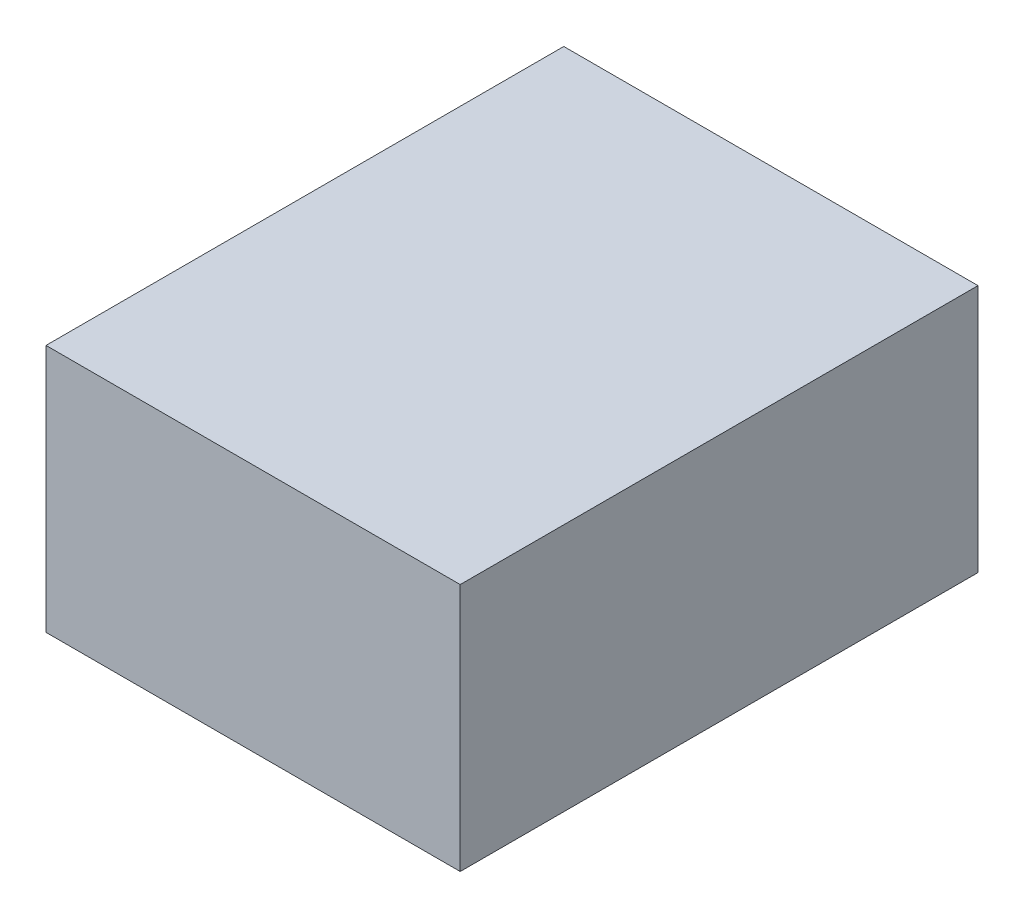
ISO-10303-21;
HEADER;
FILE_DESCRIPTION(('STEP AP214'),'2;1');
FILE_NAME('part.step','',(''),(''),'','','');
FILE_SCHEMA(('AUTOMOTIVE_DESIGN { 1 0 10303 214 1 1 1 1 }'));
ENDSEC;
DATA;
#1=APPLICATION_CONTEXT('core data for automotive mechanical design processes');
#2=APPLICATION_PROTOCOL_DEFINITION('international standard','automotive_design',2000,#1);
#3=PRODUCT_CONTEXT('',#1,'mechanical');
#4=PRODUCT('Part','Part','',(#3));
#5=PRODUCT_RELATED_PRODUCT_CATEGORY('part','',(#4));
#6=PRODUCT_DEFINITION_FORMATION('','',#4);
#7=PRODUCT_DEFINITION_CONTEXT('part definition',#1,'design');
#8=PRODUCT_DEFINITION('design','',#6,#7);
#9=PRODUCT_DEFINITION_SHAPE('','',#8);
#10=(LENGTH_UNIT() NAMED_UNIT(*) SI_UNIT(.MILLI.,.METRE.));
#11=(NAMED_UNIT(*) PLANE_ANGLE_UNIT() SI_UNIT($,.RADIAN.));
#12=(NAMED_UNIT(*) SI_UNIT($,.STERADIAN.) SOLID_ANGLE_UNIT());
#13=UNCERTAINTY_MEASURE_WITH_UNIT(LENGTH_MEASURE(1.E-05),#10,'distance_accuracy_value','');
#14=(GEOMETRIC_REPRESENTATION_CONTEXT(3) GLOBAL_UNCERTAINTY_ASSIGNED_CONTEXT((#13)) GLOBAL_UNIT_ASSIGNED_CONTEXT((#10,
#11,#12)) REPRESENTATION_CONTEXT('',''));
#15=CARTESIAN_POINT('',(0.,0.,0.));
#16=DIRECTION('',(0.,0.,1.));
#17=DIRECTION('',(1.,0.,0.));
#18=AXIS2_PLACEMENT_3D('',#15,#16,#17);
#19=CARTESIAN_POINT('',(1.,1.2,-1.25));
#20=DIRECTION('',(-1.,0.,0.));
#21=DIRECTION('',(0.,0.,1.));
#22=AXIS2_PLACEMENT_3D('',#19,#20,#21);
#23=PLANE('',#22);
#24=DIRECTION('',(0.,0.,-1.));
#25=VECTOR('',#24,1.);
#26=CARTESIAN_POINT('',(1.,0.,-1.25));
#27=LINE('',#26,#25);
#28=CARTESIAN_POINT('',(1.,0.,1.25));
#29=VERTEX_POINT('',#28);
#30=CARTESIAN_POINT('',(1.,0.,-1.25));
#31=VERTEX_POINT('',#30);
#32=EDGE_CURVE('E108',#29,#31,#27,.T.);
#33=ORIENTED_EDGE('',*,*,#32,.T.);
#34=DIRECTION('',(0.,-1.,0.));
#35=VECTOR('',#34,1.);
#36=CARTESIAN_POINT('',(1.,1.2,-1.25));
#37=LINE('',#36,#35);
#38=CARTESIAN_POINT('',(1.,1.2,-1.25));
#39=VERTEX_POINT('',#38);
#40=EDGE_CURVE('E11',#39,#31,#37,.T.);
#41=ORIENTED_EDGE('',*,*,#40,.F.);
#42=DIRECTION('',(0.,0.,-1.));
#43=VECTOR('',#42,1.);
#44=CARTESIAN_POINT('',(1.,1.2,-1.25));
#45=LINE('',#44,#43);
#46=CARTESIAN_POINT('',(1.,1.2,1.25));
#47=VERTEX_POINT('',#46);
#48=EDGE_CURVE('E96',#47,#39,#45,.T.);
#49=ORIENTED_EDGE('',*,*,#48,.F.);
#50=DIRECTION('',(0.,-1.,0.));
#51=VECTOR('',#50,1.);
#52=CARTESIAN_POINT('',(1.,1.2,1.25));
#53=LINE('',#52,#51);
#54=EDGE_CURVE('E104',#47,#29,#53,.T.);
#55=ORIENTED_EDGE('',*,*,#54,.T.);
#56=EDGE_LOOP('',(#33,#41,#49,#55));
#57=FACE_BOUND('',#56,.T.);
#58=ADVANCED_FACE('F45',(#57),#23,.F.);
#59=CARTESIAN_POINT('',(-1.,1.2,-1.25));
#60=DIRECTION('',(0.,0.,1.));
#61=DIRECTION('',(1.,0.,0.));
#62=AXIS2_PLACEMENT_3D('',#59,#60,#61);
#63=PLANE('',#62);
#64=DIRECTION('',(-1.,0.,0.));
#65=VECTOR('',#64,1.);
#66=CARTESIAN_POINT('',(-1.,0.,-1.25));
#67=LINE('',#66,#65);
#68=CARTESIAN_POINT('',(-1.,0.,-1.25));
#69=VERTEX_POINT('',#68);
#70=EDGE_CURVE('E100',#31,#69,#67,.T.);
#71=ORIENTED_EDGE('',*,*,#70,.T.);
#72=DIRECTION('',(0.,-1.,0.));
#73=VECTOR('',#72,1.);
#74=CARTESIAN_POINT('',(-1.,1.2,-1.25));
#75=LINE('',#74,#73);
#76=CARTESIAN_POINT('',(-1.,1.2,-1.25));
#77=VERTEX_POINT('',#76);
#78=EDGE_CURVE('E53',#77,#69,#75,.T.);
#79=ORIENTED_EDGE('',*,*,#78,.F.);
#80=DIRECTION('',(-1.,0.,0.));
#81=VECTOR('',#80,1.);
#82=CARTESIAN_POINT('',(-1.,1.2,-1.25));
#83=LINE('',#82,#81);
#84=EDGE_CURVE('E91',#39,#77,#83,.T.);
#85=ORIENTED_EDGE('',*,*,#84,.F.);
#86=ORIENTED_EDGE('',*,*,#40,.T.);
#87=EDGE_LOOP('',(#71,#79,#85,#86));
#88=FACE_BOUND('',#87,.T.);
#89=ADVANCED_FACE('F99',(#88),#63,.F.);
#90=CARTESIAN_POINT('',(-1.,1.2,-1.25));
#91=DIRECTION('',(1.,0.,0.));
#92=DIRECTION('',(0.,0.,-1.));
#93=AXIS2_PLACEMENT_3D('',#90,#91,#92);
#94=PLANE('',#93);
#95=DIRECTION('',(0.,0.,1.));
#96=VECTOR('',#95,1.);
#97=CARTESIAN_POINT('',(-1.,0.,-1.25));
#98=LINE('',#97,#96);
#99=CARTESIAN_POINT('',(-1.,0.,1.25));
#100=VERTEX_POINT('',#99);
#101=EDGE_CURVE('E78',#69,#100,#98,.T.);
#102=ORIENTED_EDGE('',*,*,#101,.T.);
#103=DIRECTION('',(0.,-1.,0.));
#104=VECTOR('',#103,1.);
#105=CARTESIAN_POINT('',(-1.,1.2,1.25));
#106=LINE('',#105,#104);
#107=CARTESIAN_POINT('',(-1.,1.2,1.25));
#108=VERTEX_POINT('',#107);
#109=EDGE_CURVE('E101',#108,#100,#106,.T.);
#110=ORIENTED_EDGE('',*,*,#109,.F.);
#111=DIRECTION('',(0.,0.,1.));
#112=VECTOR('',#111,1.);
#113=CARTESIAN_POINT('',(-1.,1.2,-1.25));
#114=LINE('',#113,#112);
#115=EDGE_CURVE('E94',#77,#108,#114,.T.);
#116=ORIENTED_EDGE('',*,*,#115,.F.);
#117=ORIENTED_EDGE('',*,*,#78,.T.);
#118=EDGE_LOOP('',(#102,#110,#116,#117));
#119=FACE_BOUND('',#118,.T.);
#120=ADVANCED_FACE('F102',(#119),#94,.F.);
#121=CARTESIAN_POINT('',(-1.,1.2,1.25));
#122=DIRECTION('',(0.,0.,-1.));
#123=DIRECTION('',(-1.,0.,0.));
#124=AXIS2_PLACEMENT_3D('',#121,#122,#123);
#125=PLANE('',#124);
#126=DIRECTION('',(1.,0.,0.));
#127=VECTOR('',#126,1.);
#128=CARTESIAN_POINT('',(-1.,0.,1.25));
#129=LINE('',#128,#127);
#130=EDGE_CURVE('E84',#100,#29,#129,.T.);
#131=ORIENTED_EDGE('',*,*,#130,.T.);
#132=ORIENTED_EDGE('',*,*,#54,.F.);
#133=DIRECTION('',(1.,0.,0.));
#134=VECTOR('',#133,1.);
#135=CARTESIAN_POINT('',(-1.,1.2,1.25));
#136=LINE('',#135,#134);
#137=EDGE_CURVE('E61',#108,#47,#136,.T.);
#138=ORIENTED_EDGE('',*,*,#137,.F.);
#139=ORIENTED_EDGE('',*,*,#109,.T.);
#140=EDGE_LOOP('',(#131,#132,#138,#139));
#141=FACE_BOUND('',#140,.T.);
#142=ADVANCED_FACE('F115',(#141),#125,.F.);
#143=CARTESIAN_POINT('',(0.,1.2,0.));
#144=DIRECTION('',(0.,1.,0.));
#145=DIRECTION('',(0.,0.,1.));
#146=AXIS2_PLACEMENT_3D('',#143,#144,#145);
#147=PLANE('',#146);
#148=ORIENTED_EDGE('',*,*,#48,.T.);
#149=ORIENTED_EDGE('',*,*,#84,.T.);
#150=ORIENTED_EDGE('',*,*,#115,.T.);
#151=ORIENTED_EDGE('',*,*,#137,.T.);
#152=EDGE_LOOP('',(#148,#149,#150,#151));
#153=FACE_BOUND('',#152,.T.);
#154=ADVANCED_FACE('F92',(#153),#147,.T.);
#155=CARTESIAN_POINT('',(0.,0.,0.));
#156=DIRECTION('',(0.,1.,0.));
#157=DIRECTION('',(0.,0.,1.));
#158=AXIS2_PLACEMENT_3D('',#155,#156,#157);
#159=PLANE('',#158);
#160=ORIENTED_EDGE('',*,*,#32,.F.);
#161=ORIENTED_EDGE('',*,*,#130,.F.);
#162=ORIENTED_EDGE('',*,*,#101,.F.);
#163=ORIENTED_EDGE('',*,*,#70,.F.);
#164=EDGE_LOOP('',(#160,#161,#162,#163));
#165=FACE_BOUND('',#164,.T.);
#166=ADVANCED_FACE('F118',(#165),#159,.F.);
#167=CLOSED_SHELL('',(#58,#89,#120,#142,#154,#166));
#168=MANIFOLD_SOLID_BREP('B2',#167);
#169=ADVANCED_BREP_SHAPE_REPRESENTATION('',(#18,#168),#14);
#170=SHAPE_DEFINITION_REPRESENTATION(#9,#169);
ENDSEC;
END-ISO-10303-21;
